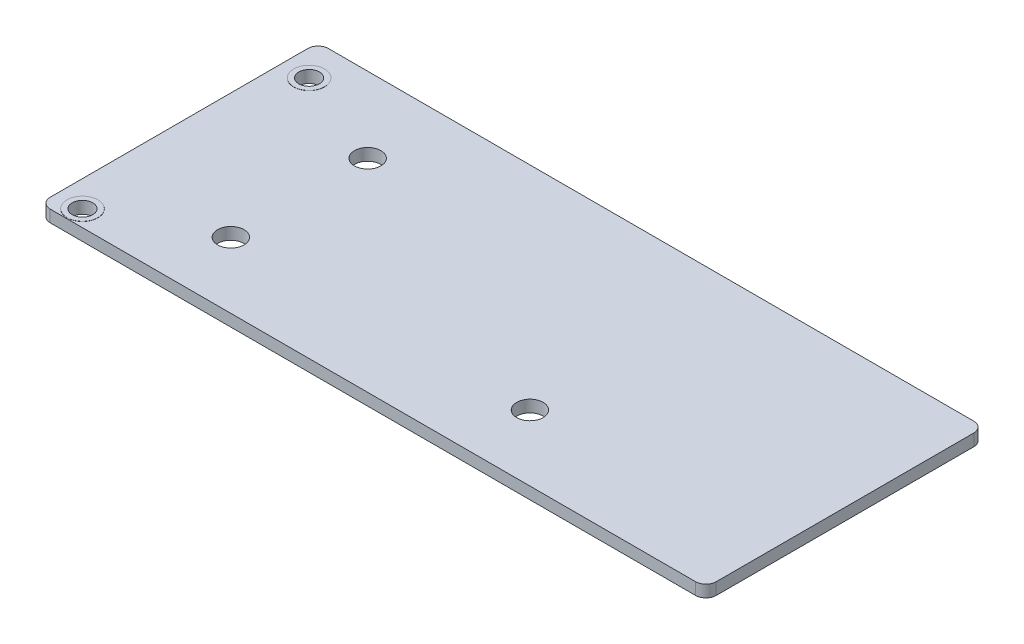
ISO-10303-21;
HEADER;
FILE_DESCRIPTION(('STEP AP214'),'2;1');
FILE_NAME('part.step','',(''),(''),'','','');
FILE_SCHEMA(('AUTOMOTIVE_DESIGN { 1 0 10303 214 1 1 1 1 }'));
ENDSEC;
DATA;
#1=APPLICATION_CONTEXT('core data for automotive mechanical design processes');
#2=APPLICATION_PROTOCOL_DEFINITION('international standard','automotive_design',2000,#1);
#3=PRODUCT_CONTEXT('',#1,'mechanical');
#4=PRODUCT('Part','Part','',(#3));
#5=PRODUCT_RELATED_PRODUCT_CATEGORY('part','',(#4));
#6=PRODUCT_DEFINITION_FORMATION('','',#4);
#7=PRODUCT_DEFINITION_CONTEXT('part definition',#1,'design');
#8=PRODUCT_DEFINITION('design','',#6,#7);
#9=PRODUCT_DEFINITION_SHAPE('','',#8);
#10=(LENGTH_UNIT() NAMED_UNIT(*) SI_UNIT(.MILLI.,.METRE.));
#11=(NAMED_UNIT(*) PLANE_ANGLE_UNIT() SI_UNIT($,.RADIAN.));
#12=(NAMED_UNIT(*) SI_UNIT($,.STERADIAN.) SOLID_ANGLE_UNIT());
#13=UNCERTAINTY_MEASURE_WITH_UNIT(LENGTH_MEASURE(1.E-05),#10,'distance_accuracy_value','');
#14=(GEOMETRIC_REPRESENTATION_CONTEXT(3) GLOBAL_UNCERTAINTY_ASSIGNED_CONTEXT((#13)) GLOBAL_UNIT_ASSIGNED_CONTEXT((#10,
#11,#12)) REPRESENTATION_CONTEXT('',''));
#15=CARTESIAN_POINT('',(0.,0.,0.));
#16=DIRECTION('',(0.,0.,1.));
#17=DIRECTION('',(1.,0.,0.));
#18=AXIS2_PLACEMENT_3D('',#15,#16,#17);
#19=CARTESIAN_POINT('',(32.325,1.16,13.5));
#20=DIRECTION('',(-1.,0.,0.));
#21=DIRECTION('',(0.,0.,1.));
#22=AXIS2_PLACEMENT_3D('',#19,#20,#21);
#23=PLANE('',#22);
#24=DIRECTION('',(0.,0.,-1.));
#25=VECTOR('',#24,1.);
#26=CARTESIAN_POINT('',(32.325,0.,13.5));
#27=LINE('',#26,#25);
#28=CARTESIAN_POINT('',(32.325,0.,12.5));
#29=VERTEX_POINT('',#28);
#30=CARTESIAN_POINT('',(32.325,0.,-12.5));
#31=VERTEX_POINT('',#30);
#32=EDGE_CURVE('E133',#29,#31,#27,.T.);
#33=ORIENTED_EDGE('',*,*,#32,.T.);
#34=DIRECTION('',(0.,-1.,0.));
#35=VECTOR('',#34,1.);
#36=CARTESIAN_POINT('',(32.325,1.16,-12.5));
#37=LINE('',#36,#35);
#38=CARTESIAN_POINT('',(32.325,1.16,-12.5));
#39=VERTEX_POINT('',#38);
#40=EDGE_CURVE('E156',#31,#39,#37,.F.);
#41=ORIENTED_EDGE('',*,*,#40,.T.);
#42=DIRECTION('',(0.,0.,-1.));
#43=VECTOR('',#42,1.);
#44=CARTESIAN_POINT('',(32.325,1.16,13.5));
#45=LINE('',#44,#43);
#46=CARTESIAN_POINT('',(32.325,1.16,12.5));
#47=VERTEX_POINT('',#46);
#48=EDGE_CURVE('E131',#47,#39,#45,.T.);
#49=ORIENTED_EDGE('',*,*,#48,.F.);
#50=DIRECTION('',(0.,-1.,0.));
#51=VECTOR('',#50,1.);
#52=CARTESIAN_POINT('',(32.325,1.16,12.5));
#53=LINE('',#52,#51);
#54=EDGE_CURVE('E153',#47,#29,#53,.T.);
#55=ORIENTED_EDGE('',*,*,#54,.T.);
#56=EDGE_LOOP('',(#33,#41,#49,#55));
#57=FACE_BOUND('',#56,.T.);
#58=ADVANCED_FACE('F36',(#57),#23,.F.);
#59=CARTESIAN_POINT('',(-32.325,1.16,-13.5));
#60=DIRECTION('',(0.,0.,1.));
#61=DIRECTION('',(1.,0.,0.));
#62=AXIS2_PLACEMENT_3D('',#59,#60,#61);
#63=PLANE('',#62);
#64=DIRECTION('',(-1.,0.,0.));
#65=VECTOR('',#64,1.);
#66=CARTESIAN_POINT('',(-32.325,0.,-13.5));
#67=LINE('',#66,#65);
#68=CARTESIAN_POINT('',(31.325,0.,-13.5));
#69=VERTEX_POINT('',#68);
#70=CARTESIAN_POINT('',(-31.325,0.,-13.5));
#71=VERTEX_POINT('',#70);
#72=EDGE_CURVE('E129',#69,#71,#67,.T.);
#73=ORIENTED_EDGE('',*,*,#72,.T.);
#74=DIRECTION('',(0.,-1.,0.));
#75=VECTOR('',#74,1.);
#76=CARTESIAN_POINT('',(-31.325,1.16,-13.5));
#77=LINE('',#76,#75);
#78=CARTESIAN_POINT('',(-31.325,1.16,-13.5));
#79=VERTEX_POINT('',#78);
#80=EDGE_CURVE('E108',#71,#79,#77,.F.);
#81=ORIENTED_EDGE('',*,*,#80,.T.);
#82=DIRECTION('',(-1.,0.,0.));
#83=VECTOR('',#82,1.);
#84=CARTESIAN_POINT('',(-32.325,1.16,-13.5));
#85=LINE('',#84,#83);
#86=CARTESIAN_POINT('',(31.325,1.16,-13.5));
#87=VERTEX_POINT('',#86);
#88=EDGE_CURVE('E195',#87,#79,#85,.T.);
#89=ORIENTED_EDGE('',*,*,#88,.F.);
#90=DIRECTION('',(0.,-1.,0.));
#91=VECTOR('',#90,1.);
#92=CARTESIAN_POINT('',(31.325,1.16,-13.5));
#93=LINE('',#92,#91);
#94=EDGE_CURVE('E113',#87,#69,#93,.T.);
#95=ORIENTED_EDGE('',*,*,#94,.T.);
#96=EDGE_LOOP('',(#73,#81,#89,#95));
#97=FACE_BOUND('',#96,.T.);
#98=ADVANCED_FACE('F214',(#97),#63,.F.);
#99=CARTESIAN_POINT('',(-32.325,1.16,13.5));
#100=DIRECTION('',(1.,0.,0.));
#101=DIRECTION('',(0.,0.,-1.));
#102=AXIS2_PLACEMENT_3D('',#99,#100,#101);
#103=PLANE('',#102);
#104=DIRECTION('',(0.,0.,1.));
#105=VECTOR('',#104,1.);
#106=CARTESIAN_POINT('',(-32.325,1.16,13.5));
#107=LINE('',#106,#105);
#108=CARTESIAN_POINT('',(-32.325,1.16,-12.5));
#109=VERTEX_POINT('',#108);
#110=CARTESIAN_POINT('',(-32.325,1.16,12.5));
#111=VERTEX_POINT('',#110);
#112=EDGE_CURVE('E122',#109,#111,#107,.T.);
#113=ORIENTED_EDGE('',*,*,#112,.F.);
#114=DIRECTION('',(0.,-1.,0.));
#115=VECTOR('',#114,1.);
#116=CARTESIAN_POINT('',(-32.325,1.16,-12.5));
#117=LINE('',#116,#115);
#118=CARTESIAN_POINT('',(-32.325,0.,-12.5));
#119=VERTEX_POINT('',#118);
#120=EDGE_CURVE('E107',#109,#119,#117,.T.);
#121=ORIENTED_EDGE('',*,*,#120,.T.);
#122=DIRECTION('',(0.,0.,1.));
#123=VECTOR('',#122,1.);
#124=CARTESIAN_POINT('',(-32.325,0.,13.5));
#125=LINE('',#124,#123);
#126=CARTESIAN_POINT('',(-32.325,0.,12.5));
#127=VERTEX_POINT('',#126);
#128=EDGE_CURVE('E120',#119,#127,#125,.T.);
#129=ORIENTED_EDGE('',*,*,#128,.T.);
#130=DIRECTION('',(0.,-1.,0.));
#131=VECTOR('',#130,1.);
#132=CARTESIAN_POINT('',(-32.325,1.16,12.5));
#133=LINE('',#132,#131);
#134=EDGE_CURVE('E124',#127,#111,#133,.F.);
#135=ORIENTED_EDGE('',*,*,#134,.T.);
#136=EDGE_LOOP('',(#113,#121,#129,#135));
#137=FACE_BOUND('',#136,.T.);
#138=ADVANCED_FACE('F119',(#137),#103,.F.);
#139=CARTESIAN_POINT('',(-32.325,1.16,13.5));
#140=DIRECTION('',(0.,0.,-1.));
#141=DIRECTION('',(-1.,0.,0.));
#142=AXIS2_PLACEMENT_3D('',#139,#140,#141);
#143=PLANE('',#142);
#144=DIRECTION('',(1.,0.,0.));
#145=VECTOR('',#144,1.);
#146=CARTESIAN_POINT('',(-32.325,0.,13.5));
#147=LINE('',#146,#145);
#148=CARTESIAN_POINT('',(-31.325,0.,13.5));
#149=VERTEX_POINT('',#148);
#150=CARTESIAN_POINT('',(31.325,0.,13.5));
#151=VERTEX_POINT('',#150);
#152=EDGE_CURVE('E128',#149,#151,#147,.T.);
#153=ORIENTED_EDGE('',*,*,#152,.T.);
#154=DIRECTION('',(0.,-1.,0.));
#155=VECTOR('',#154,1.);
#156=CARTESIAN_POINT('',(31.325,1.16,13.5));
#157=LINE('',#156,#155);
#158=CARTESIAN_POINT('',(31.325,1.16,13.5));
#159=VERTEX_POINT('',#158);
#160=EDGE_CURVE('E51',#151,#159,#157,.F.);
#161=ORIENTED_EDGE('',*,*,#160,.T.);
#162=DIRECTION('',(1.,0.,0.));
#163=VECTOR('',#162,1.);
#164=CARTESIAN_POINT('',(-32.325,1.16,13.5));
#165=LINE('',#164,#163);
#166=CARTESIAN_POINT('',(-31.325,1.16,13.5));
#167=VERTEX_POINT('',#166);
#168=EDGE_CURVE('E137',#167,#159,#165,.T.);
#169=ORIENTED_EDGE('',*,*,#168,.F.);
#170=DIRECTION('',(0.,-1.,0.));
#171=VECTOR('',#170,1.);
#172=CARTESIAN_POINT('',(-31.325,1.16,13.5));
#173=LINE('',#172,#171);
#174=EDGE_CURVE('E158',#167,#149,#173,.T.);
#175=ORIENTED_EDGE('',*,*,#174,.T.);
#176=EDGE_LOOP('',(#153,#161,#169,#175));
#177=FACE_BOUND('',#176,.T.);
#178=ADVANCED_FACE('F216',(#177),#143,.F.);
#179=CARTESIAN_POINT('',(0.,1.16,0.));
#180=DIRECTION('',(0.,-1.,0.));
#181=DIRECTION('',(0.,0.,-1.));
#182=AXIS2_PLACEMENT_3D('',#179,#180,#181);
#183=PLANE('',#182);
#184=CARTESIAN_POINT('',(-29.775,1.16,-10.08));
#185=DIRECTION('',(0.,-1.,0.));
#186=DIRECTION('',(0.,0.,-1.));
#187=AXIS2_PLACEMENT_3D('',#184,#185,#186);
#188=CIRCLE('',#187,1.5);
#189=CARTESIAN_POINT('',(-29.775,1.16,-11.58));
#190=VERTEX_POINT('',#189);
#191=EDGE_CURVE('E309',#190,#190,#188,.T.);
#192=ORIENTED_EDGE('',*,*,#191,.T.);
#193=EDGE_LOOP('',(#192));
#194=FACE_BOUND('',#193,.T.);
#195=CARTESIAN_POINT('',(-29.775,1.16,11.92));
#196=DIRECTION('',(0.,-1.,0.));
#197=DIRECTION('',(0.,0.,-1.));
#198=AXIS2_PLACEMENT_3D('',#195,#196,#197);
#199=CIRCLE('',#198,1.5);
#200=CARTESIAN_POINT('',(-29.775,1.16,10.42));
#201=VERTEX_POINT('',#200);
#202=EDGE_CURVE('E324',#201,#201,#199,.T.);
#203=ORIENTED_EDGE('',*,*,#202,.T.);
#204=EDGE_LOOP('',(#203));
#205=FACE_BOUND('',#204,.T.);
#206=CARTESIAN_POINT('',(8.845,1.16,7.105));
#207=DIRECTION('',(0.,1.,0.));
#208=DIRECTION('',(0.,0.,1.));
#209=AXIS2_PLACEMENT_3D('',#206,#207,#208);
#210=CIRCLE('',#209,1.285);
#211=CARTESIAN_POINT('',(8.845,1.16,8.39));
#212=VERTEX_POINT('',#211);
#213=EDGE_CURVE('E190',#212,#212,#210,.T.);
#214=ORIENTED_EDGE('',*,*,#213,.F.);
#215=EDGE_LOOP('',(#214));
#216=FACE_BOUND('',#215,.T.);
#217=CARTESIAN_POINT('',(-20.19,1.16,-6.18));
#218=DIRECTION('',(0.,1.,0.));
#219=DIRECTION('',(0.,0.,1.));
#220=AXIS2_PLACEMENT_3D('',#217,#218,#219);
#221=CIRCLE('',#220,1.285);
#222=CARTESIAN_POINT('',(-20.19,1.16,-4.895));
#223=VERTEX_POINT('',#222);
#224=EDGE_CURVE('E328',#223,#223,#221,.T.);
#225=ORIENTED_EDGE('',*,*,#224,.F.);
#226=EDGE_LOOP('',(#225));
#227=FACE_BOUND('',#226,.T.);
#228=CARTESIAN_POINT('',(-20.19,1.16,7.105));
#229=DIRECTION('',(0.,1.,0.));
#230=DIRECTION('',(0.,0.,1.));
#231=AXIS2_PLACEMENT_3D('',#228,#229,#230);
#232=CIRCLE('',#231,1.285);
#233=CARTESIAN_POINT('',(-20.19,1.16,8.39));
#234=VERTEX_POINT('',#233);
#235=EDGE_CURVE('E184',#234,#234,#232,.T.);
#236=ORIENTED_EDGE('',*,*,#235,.F.);
#237=EDGE_LOOP('',(#236));
#238=FACE_BOUND('',#237,.T.);
#239=ORIENTED_EDGE('',*,*,#88,.T.);
#240=CARTESIAN_POINT('',(-31.325,1.16,-12.5));
#241=DIRECTION('',(0.,-1.,0.));
#242=DIRECTION('',(0.,0.,-1.));
#243=AXIS2_PLACEMENT_3D('',#240,#241,#242);
#244=CIRCLE('',#243,1.);
#245=EDGE_CURVE('E151',#79,#109,#244,.F.);
#246=ORIENTED_EDGE('',*,*,#245,.T.);
#247=ORIENTED_EDGE('',*,*,#112,.T.);
#248=CARTESIAN_POINT('',(-31.325,1.16,12.5));
#249=DIRECTION('',(0.,-1.,0.));
#250=DIRECTION('',(0.,0.,-1.));
#251=AXIS2_PLACEMENT_3D('',#248,#249,#250);
#252=CIRCLE('',#251,1.);
#253=EDGE_CURVE('E58',#111,#167,#252,.F.);
#254=ORIENTED_EDGE('',*,*,#253,.T.);
#255=ORIENTED_EDGE('',*,*,#168,.T.);
#256=CARTESIAN_POINT('',(31.325,1.16,12.5));
#257=DIRECTION('',(0.,-1.,0.));
#258=DIRECTION('',(0.,0.,-1.));
#259=AXIS2_PLACEMENT_3D('',#256,#257,#258);
#260=CIRCLE('',#259,1.);
#261=EDGE_CURVE('E147',#159,#47,#260,.F.);
#262=ORIENTED_EDGE('',*,*,#261,.T.);
#263=ORIENTED_EDGE('',*,*,#48,.T.);
#264=CARTESIAN_POINT('',(31.325,1.16,-12.5));
#265=DIRECTION('',(0.,-1.,0.));
#266=DIRECTION('',(0.,0.,-1.));
#267=AXIS2_PLACEMENT_3D('',#264,#265,#266);
#268=CIRCLE('',#267,1.);
#269=EDGE_CURVE('E149',#39,#87,#268,.F.);
#270=ORIENTED_EDGE('',*,*,#269,.T.);
#271=EDGE_LOOP('',(#239,#246,#247,#254,#255,#262,#263,#270));
#272=FACE_BOUND('',#271,.T.);
#273=ADVANCED_FACE('F169',(#194,#205,#216,#227,#238,#272),#183,.F.);
#274=CARTESIAN_POINT('',(0.,0.,0.));
#275=DIRECTION('',(0.,-1.,0.));
#276=DIRECTION('',(0.,0.,-1.));
#277=AXIS2_PLACEMENT_3D('',#274,#275,#276);
#278=PLANE('',#277);
#279=CARTESIAN_POINT('',(-29.775,0.,-10.08));
#280=DIRECTION('',(0.,-1.,0.));
#281=DIRECTION('',(0.,0.,-1.));
#282=AXIS2_PLACEMENT_3D('',#279,#280,#281);
#283=CIRCLE('',#282,1.5);
#284=CARTESIAN_POINT('',(-29.775,0.,-11.58));
#285=VERTEX_POINT('',#284);
#286=EDGE_CURVE('E11',#285,#285,#283,.T.);
#287=ORIENTED_EDGE('',*,*,#286,.F.);
#288=EDGE_LOOP('',(#287));
#289=FACE_BOUND('',#288,.T.);
#290=CARTESIAN_POINT('',(-29.775,0.,11.92));
#291=DIRECTION('',(0.,-1.,0.));
#292=DIRECTION('',(0.,0.,-1.));
#293=AXIS2_PLACEMENT_3D('',#290,#291,#292);
#294=CIRCLE('',#293,1.5);
#295=CARTESIAN_POINT('',(-29.775,0.,10.42));
#296=VERTEX_POINT('',#295);
#297=EDGE_CURVE('E44',#296,#296,#294,.T.);
#298=ORIENTED_EDGE('',*,*,#297,.F.);
#299=EDGE_LOOP('',(#298));
#300=FACE_BOUND('',#299,.T.);
#301=CARTESIAN_POINT('',(8.845,0.,7.105));
#302=DIRECTION('',(0.,1.,0.));
#303=DIRECTION('',(0.,0.,1.));
#304=AXIS2_PLACEMENT_3D('',#301,#302,#303);
#305=CIRCLE('',#304,1.285);
#306=CARTESIAN_POINT('',(8.845,0.,8.39));
#307=VERTEX_POINT('',#306);
#308=EDGE_CURVE('E175',#307,#307,#305,.T.);
#309=ORIENTED_EDGE('',*,*,#308,.T.);
#310=EDGE_LOOP('',(#309));
#311=FACE_BOUND('',#310,.T.);
#312=CARTESIAN_POINT('',(-20.19,0.,-6.18));
#313=DIRECTION('',(0.,1.,0.));
#314=DIRECTION('',(0.,0.,1.));
#315=AXIS2_PLACEMENT_3D('',#312,#313,#314);
#316=CIRCLE('',#315,1.285);
#317=CARTESIAN_POINT('',(-20.19,0.,-4.895));
#318=VERTEX_POINT('',#317);
#319=EDGE_CURVE('E179',#318,#318,#316,.T.);
#320=ORIENTED_EDGE('',*,*,#319,.T.);
#321=EDGE_LOOP('',(#320));
#322=FACE_BOUND('',#321,.T.);
#323=CARTESIAN_POINT('',(-20.19,0.,7.105));
#324=DIRECTION('',(0.,1.,0.));
#325=DIRECTION('',(0.,0.,1.));
#326=AXIS2_PLACEMENT_3D('',#323,#324,#325);
#327=CIRCLE('',#326,1.285);
#328=CARTESIAN_POINT('',(-20.19,0.,8.39));
#329=VERTEX_POINT('',#328);
#330=EDGE_CURVE('E182',#329,#329,#327,.T.);
#331=ORIENTED_EDGE('',*,*,#330,.T.);
#332=EDGE_LOOP('',(#331));
#333=FACE_BOUND('',#332,.T.);
#334=ORIENTED_EDGE('',*,*,#128,.F.);
#335=CARTESIAN_POINT('',(-31.325,0.,-12.5));
#336=DIRECTION('',(0.,-1.,0.));
#337=DIRECTION('',(0.,0.,-1.));
#338=AXIS2_PLACEMENT_3D('',#335,#336,#337);
#339=CIRCLE('',#338,1.);
#340=EDGE_CURVE('E103',#119,#71,#339,.T.);
#341=ORIENTED_EDGE('',*,*,#340,.T.);
#342=ORIENTED_EDGE('',*,*,#72,.F.);
#343=CARTESIAN_POINT('',(31.325,0.,-12.5));
#344=DIRECTION('',(0.,-1.,0.));
#345=DIRECTION('',(0.,0.,-1.));
#346=AXIS2_PLACEMENT_3D('',#343,#344,#345);
#347=CIRCLE('',#346,1.);
#348=EDGE_CURVE('E114',#69,#31,#347,.T.);
#349=ORIENTED_EDGE('',*,*,#348,.T.);
#350=ORIENTED_EDGE('',*,*,#32,.F.);
#351=CARTESIAN_POINT('',(31.325,0.,12.5));
#352=DIRECTION('',(0.,-1.,0.));
#353=DIRECTION('',(0.,0.,-1.));
#354=AXIS2_PLACEMENT_3D('',#351,#352,#353);
#355=CIRCLE('',#354,1.);
#356=EDGE_CURVE('E140',#29,#151,#355,.T.);
#357=ORIENTED_EDGE('',*,*,#356,.T.);
#358=ORIENTED_EDGE('',*,*,#152,.F.);
#359=CARTESIAN_POINT('',(-31.325,0.,12.5));
#360=DIRECTION('',(0.,-1.,0.));
#361=DIRECTION('',(0.,0.,-1.));
#362=AXIS2_PLACEMENT_3D('',#359,#360,#361);
#363=CIRCLE('',#362,1.);
#364=EDGE_CURVE('E123',#149,#127,#363,.T.);
#365=ORIENTED_EDGE('',*,*,#364,.T.);
#366=EDGE_LOOP('',(#334,#341,#342,#349,#350,#357,#358,#365));
#367=FACE_BOUND('',#366,.T.);
#368=ADVANCED_FACE('F126',(#289,#300,#311,#322,#333,#367),#278,.T.);
#369=CARTESIAN_POINT('',(-31.325,1.16,-12.5));
#370=DIRECTION('',(0.,-1.,0.));
#371=DIRECTION('',(0.,0.,-1.));
#372=AXIS2_PLACEMENT_3D('',#369,#370,#371);
#373=CYLINDRICAL_SURFACE('',#372,1.);
#374=ORIENTED_EDGE('',*,*,#245,.F.);
#375=ORIENTED_EDGE('',*,*,#80,.F.);
#376=ORIENTED_EDGE('',*,*,#340,.F.);
#377=ORIENTED_EDGE('',*,*,#120,.F.);
#378=EDGE_LOOP('',(#374,#375,#376,#377));
#379=FACE_BOUND('',#378,.T.);
#380=ADVANCED_FACE('F106',(#379),#373,.T.);
#381=CARTESIAN_POINT('',(31.325,1.16,-12.5));
#382=DIRECTION('',(0.,-1.,0.));
#383=DIRECTION('',(0.,0.,-1.));
#384=AXIS2_PLACEMENT_3D('',#381,#382,#383);
#385=CYLINDRICAL_SURFACE('',#384,1.);
#386=ORIENTED_EDGE('',*,*,#269,.F.);
#387=ORIENTED_EDGE('',*,*,#40,.F.);
#388=ORIENTED_EDGE('',*,*,#348,.F.);
#389=ORIENTED_EDGE('',*,*,#94,.F.);
#390=EDGE_LOOP('',(#386,#387,#388,#389));
#391=FACE_BOUND('',#390,.T.);
#392=ADVANCED_FACE('F211',(#391),#385,.T.);
#393=CARTESIAN_POINT('',(31.325,1.16,12.5));
#394=DIRECTION('',(0.,-1.,0.));
#395=DIRECTION('',(0.,0.,-1.));
#396=AXIS2_PLACEMENT_3D('',#393,#394,#395);
#397=CYLINDRICAL_SURFACE('',#396,1.);
#398=ORIENTED_EDGE('',*,*,#261,.F.);
#399=ORIENTED_EDGE('',*,*,#160,.F.);
#400=ORIENTED_EDGE('',*,*,#356,.F.);
#401=ORIENTED_EDGE('',*,*,#54,.F.);
#402=EDGE_LOOP('',(#398,#399,#400,#401));
#403=FACE_BOUND('',#402,.T.);
#404=ADVANCED_FACE('F204',(#403),#397,.T.);
#405=CARTESIAN_POINT('',(-31.325,1.16,12.5));
#406=DIRECTION('',(0.,-1.,0.));
#407=DIRECTION('',(0.,0.,-1.));
#408=AXIS2_PLACEMENT_3D('',#405,#406,#407);
#409=CYLINDRICAL_SURFACE('',#408,1.);
#410=ORIENTED_EDGE('',*,*,#253,.F.);
#411=ORIENTED_EDGE('',*,*,#134,.F.);
#412=ORIENTED_EDGE('',*,*,#364,.F.);
#413=ORIENTED_EDGE('',*,*,#174,.F.);
#414=EDGE_LOOP('',(#410,#411,#412,#413));
#415=FACE_BOUND('',#414,.T.);
#416=ADVANCED_FACE('F38',(#415),#409,.T.);
#417=CARTESIAN_POINT('',(-20.19,0.,7.105));
#418=DIRECTION('',(0.,1.,0.));
#419=DIRECTION('',(0.,0.,1.));
#420=AXIS2_PLACEMENT_3D('',#417,#418,#419);
#421=CYLINDRICAL_SURFACE('',#420,1.285);
#422=ORIENTED_EDGE('',*,*,#330,.F.);
#423=EDGE_LOOP('',(#422));
#424=FACE_BOUND('',#423,.T.);
#425=ORIENTED_EDGE('',*,*,#235,.T.);
#426=EDGE_LOOP('',(#425));
#427=FACE_BOUND('',#426,.T.);
#428=ADVANCED_FACE('F240',(#424,#427),#421,.F.);
#429=CARTESIAN_POINT('',(-20.19,0.,-6.18));
#430=DIRECTION('',(0.,1.,0.));
#431=DIRECTION('',(0.,0.,1.));
#432=AXIS2_PLACEMENT_3D('',#429,#430,#431);
#433=CYLINDRICAL_SURFACE('',#432,1.285);
#434=ORIENTED_EDGE('',*,*,#319,.F.);
#435=EDGE_LOOP('',(#434));
#436=FACE_BOUND('',#435,.T.);
#437=ORIENTED_EDGE('',*,*,#224,.T.);
#438=EDGE_LOOP('',(#437));
#439=FACE_BOUND('',#438,.T.);
#440=ADVANCED_FACE('F244',(#436,#439),#433,.F.);
#441=CARTESIAN_POINT('',(8.845,0.,7.105));
#442=DIRECTION('',(0.,1.,0.));
#443=DIRECTION('',(0.,0.,1.));
#444=AXIS2_PLACEMENT_3D('',#441,#442,#443);
#445=CYLINDRICAL_SURFACE('',#444,1.285);
#446=ORIENTED_EDGE('',*,*,#308,.F.);
#447=EDGE_LOOP('',(#446));
#448=FACE_BOUND('',#447,.T.);
#449=ORIENTED_EDGE('',*,*,#213,.T.);
#450=EDGE_LOOP('',(#449));
#451=FACE_BOUND('',#450,.T.);
#452=ADVANCED_FACE('F249',(#448,#451),#445,.F.);
#453=CARTESIAN_POINT('',(-29.775,-0.0049999999999998,11.92));
#454=DIRECTION('',(0.,1.,0.));
#455=DIRECTION('',(0.,0.,1.));
#456=AXIS2_PLACEMENT_3D('',#453,#454,#455);
#457=CYLINDRICAL_SURFACE('',#456,1.5);
#458=ORIENTED_EDGE('',*,*,#297,.T.);
#459=EDGE_LOOP('',(#458));
#460=FACE_BOUND('',#459,.T.);
#461=CARTESIAN_POINT('',(-29.775,-0.0049999999999998,11.92));
#462=DIRECTION('',(0.,1.,0.));
#463=DIRECTION('',(0.,0.,1.));
#464=AXIS2_PLACEMENT_3D('',#461,#462,#463);
#465=CIRCLE('',#464,1.5);
#466=CARTESIAN_POINT('',(-29.775,-0.0049999999999998,13.42));
#467=VERTEX_POINT('',#466);
#468=EDGE_CURVE('E321',#467,#467,#465,.T.);
#469=ORIENTED_EDGE('',*,*,#468,.T.);
#470=EDGE_LOOP('',(#469));
#471=FACE_BOUND('',#470,.T.);
#472=ADVANCED_FACE('F164',(#460,#471),#457,.T.);
#473=CARTESIAN_POINT('',(-29.775,-0.0049999999999998,11.92));
#474=DIRECTION('',(0.,1.,0.));
#475=DIRECTION('',(0.,0.,1.));
#476=AXIS2_PLACEMENT_3D('',#473,#474,#475);
#477=PLANE('',#476);
#478=CARTESIAN_POINT('',(-29.775,-0.0049999999999998,11.92));
#479=DIRECTION('',(0.,1.,0.));
#480=DIRECTION('',(0.,0.,1.));
#481=AXIS2_PLACEMENT_3D('',#478,#479,#480);
#482=CIRCLE('',#481,1.);
#483=CARTESIAN_POINT('',(-29.775,-0.0049999999999998,12.92));
#484=VERTEX_POINT('',#483);
#485=EDGE_CURVE('E318',#484,#484,#482,.T.);
#486=ORIENTED_EDGE('',*,*,#485,.T.);
#487=EDGE_LOOP('',(#486));
#488=FACE_BOUND('',#487,.T.);
#489=ORIENTED_EDGE('',*,*,#468,.F.);
#490=EDGE_LOOP('',(#489));
#491=FACE_BOUND('',#490,.T.);
#492=ADVANCED_FACE('F267',(#488,#491),#477,.F.);
#493=CARTESIAN_POINT('',(-29.775,0.,11.92));
#494=DIRECTION('',(0.,1.,0.));
#495=DIRECTION('',(0.,0.,1.));
#496=AXIS2_PLACEMENT_3D('',#493,#494,#495);
#497=CYLINDRICAL_SURFACE('',#496,1.);
#498=ORIENTED_EDGE('',*,*,#485,.F.);
#499=EDGE_LOOP('',(#498));
#500=FACE_BOUND('',#499,.T.);
#501=CARTESIAN_POINT('',(-29.775,1.175,11.92));
#502=DIRECTION('',(0.,1.,0.));
#503=DIRECTION('',(0.,0.,1.));
#504=AXIS2_PLACEMENT_3D('',#501,#502,#503);
#505=CIRCLE('',#504,1.);
#506=CARTESIAN_POINT('',(-29.775,1.175,12.92));
#507=VERTEX_POINT('',#506);
#508=EDGE_CURVE('E312',#507,#507,#505,.T.);
#509=ORIENTED_EDGE('',*,*,#508,.T.);
#510=EDGE_LOOP('',(#509));
#511=FACE_BOUND('',#510,.T.);
#512=ADVANCED_FACE('F263',(#500,#511),#497,.F.);
#513=CARTESIAN_POINT('',(-29.775,1.175,11.92));
#514=DIRECTION('',(0.,1.,0.));
#515=DIRECTION('',(0.,0.,1.));
#516=AXIS2_PLACEMENT_3D('',#513,#514,#515);
#517=CIRCLE('',#516,1.5);
#518=CARTESIAN_POINT('',(-29.775,1.175,13.42));
#519=VERTEX_POINT('',#518);
#520=EDGE_CURVE('E315',#519,#519,#517,.T.);
#521=ORIENTED_EDGE('',*,*,#520,.F.);
#522=EDGE_LOOP('',(#521));
#523=FACE_BOUND('',#522,.T.);
#524=ORIENTED_EDGE('',*,*,#202,.F.);
#525=EDGE_LOOP('',(#524));
#526=FACE_BOUND('',#525,.T.);
#527=ADVANCED_FACE('F266',(#523,#526),#457,.T.);
#528=CARTESIAN_POINT('',(-29.775,1.175,11.92));
#529=DIRECTION('',(0.,1.,0.));
#530=DIRECTION('',(0.,0.,1.));
#531=AXIS2_PLACEMENT_3D('',#528,#529,#530);
#532=PLANE('',#531);
#533=ORIENTED_EDGE('',*,*,#520,.T.);
#534=EDGE_LOOP('',(#533));
#535=FACE_BOUND('',#534,.T.);
#536=ORIENTED_EDGE('',*,*,#508,.F.);
#537=EDGE_LOOP('',(#536));
#538=FACE_BOUND('',#537,.T.);
#539=ADVANCED_FACE('F274',(#535,#538),#532,.T.);
#540=CARTESIAN_POINT('',(-29.775,-0.0049999999999998,-10.08));
#541=DIRECTION('',(0.,1.,0.));
#542=DIRECTION('',(0.,0.,1.));
#543=AXIS2_PLACEMENT_3D('',#540,#541,#542);
#544=CYLINDRICAL_SURFACE('',#543,1.5);
#545=ORIENTED_EDGE('',*,*,#286,.T.);
#546=EDGE_LOOP('',(#545));
#547=FACE_BOUND('',#546,.T.);
#548=CARTESIAN_POINT('',(-29.775,-0.0049999999999998,-10.08));
#549=DIRECTION('',(0.,1.,0.));
#550=DIRECTION('',(0.,0.,1.));
#551=AXIS2_PLACEMENT_3D('',#548,#549,#550);
#552=CIRCLE('',#551,1.5);
#553=CARTESIAN_POINT('',(-29.775,-0.0049999999999998,-8.58));
#554=VERTEX_POINT('',#553);
#555=EDGE_CURVE('E306',#554,#554,#552,.T.);
#556=ORIENTED_EDGE('',*,*,#555,.T.);
#557=EDGE_LOOP('',(#556));
#558=FACE_BOUND('',#557,.T.);
#559=ADVANCED_FACE('F277',(#547,#558),#544,.T.);
#560=CARTESIAN_POINT('',(-29.775,-0.0049999999999998,-10.08));
#561=DIRECTION('',(0.,1.,0.));
#562=DIRECTION('',(0.,0.,1.));
#563=AXIS2_PLACEMENT_3D('',#560,#561,#562);
#564=PLANE('',#563);
#565=CARTESIAN_POINT('',(-29.775,-0.0049999999999998,-10.08));
#566=DIRECTION('',(0.,1.,0.));
#567=DIRECTION('',(0.,0.,1.));
#568=AXIS2_PLACEMENT_3D('',#565,#566,#567);
#569=CIRCLE('',#568,1.);
#570=CARTESIAN_POINT('',(-29.775,-0.0049999999999998,-9.08));
#571=VERTEX_POINT('',#570);
#572=EDGE_CURVE('E301',#571,#571,#569,.T.);
#573=ORIENTED_EDGE('',*,*,#572,.T.);
#574=EDGE_LOOP('',(#573));
#575=FACE_BOUND('',#574,.T.);
#576=ORIENTED_EDGE('',*,*,#555,.F.);
#577=EDGE_LOOP('',(#576));
#578=FACE_BOUND('',#577,.T.);
#579=ADVANCED_FACE('F258',(#575,#578),#564,.F.);
#580=CARTESIAN_POINT('',(-29.775,0.,-10.08));
#581=DIRECTION('',(0.,1.,0.));
#582=DIRECTION('',(0.,0.,1.));
#583=AXIS2_PLACEMENT_3D('',#580,#581,#582);
#584=CYLINDRICAL_SURFACE('',#583,1.);
#585=ORIENTED_EDGE('',*,*,#572,.F.);
#586=EDGE_LOOP('',(#585));
#587=FACE_BOUND('',#586,.T.);
#588=CARTESIAN_POINT('',(-29.775,1.175,-10.08));
#589=DIRECTION('',(0.,1.,0.));
#590=DIRECTION('',(0.,0.,1.));
#591=AXIS2_PLACEMENT_3D('',#588,#589,#590);
#592=CIRCLE('',#591,1.);
#593=CARTESIAN_POINT('',(-29.775,1.175,-9.08));
#594=VERTEX_POINT('',#593);
#595=EDGE_CURVE('E298',#594,#594,#592,.T.);
#596=ORIENTED_EDGE('',*,*,#595,.T.);
#597=EDGE_LOOP('',(#596));
#598=FACE_BOUND('',#597,.T.);
#599=ADVANCED_FACE('F254',(#587,#598),#584,.F.);
#600=CARTESIAN_POINT('',(-29.775,1.175,-10.08));
#601=DIRECTION('',(0.,1.,0.));
#602=DIRECTION('',(0.,0.,1.));
#603=AXIS2_PLACEMENT_3D('',#600,#601,#602);
#604=CIRCLE('',#603,1.5);
#605=CARTESIAN_POINT('',(-29.775,1.175,-8.58));
#606=VERTEX_POINT('',#605);
#607=EDGE_CURVE('E295',#606,#606,#604,.T.);
#608=ORIENTED_EDGE('',*,*,#607,.F.);
#609=EDGE_LOOP('',(#608));
#610=FACE_BOUND('',#609,.T.);
#611=ORIENTED_EDGE('',*,*,#191,.F.);
#612=EDGE_LOOP('',(#611));
#613=FACE_BOUND('',#612,.T.);
#614=ADVANCED_FACE('F257',(#610,#613),#544,.T.);
#615=CARTESIAN_POINT('',(-29.775,1.175,-10.08));
#616=DIRECTION('',(0.,1.,0.));
#617=DIRECTION('',(0.,0.,1.));
#618=AXIS2_PLACEMENT_3D('',#615,#616,#617);
#619=PLANE('',#618);
#620=ORIENTED_EDGE('',*,*,#607,.T.);
#621=EDGE_LOOP('',(#620));
#622=FACE_BOUND('',#621,.T.);
#623=ORIENTED_EDGE('',*,*,#595,.F.);
#624=EDGE_LOOP('',(#623));
#625=FACE_BOUND('',#624,.T.);
#626=ADVANCED_FACE('F285',(#622,#625),#619,.T.);
#627=CLOSED_SHELL('',(#58,#98,#138,#178,#273,#368,#380,#392,#404,#416,#428,#440,#452,#472,#492,
#512,#527,#539,#559,#579,#599,#614,#626));
#628=MANIFOLD_SOLID_BREP('B2',#627);
#629=ADVANCED_BREP_SHAPE_REPRESENTATION('',(#18,#628),#14);
#630=SHAPE_DEFINITION_REPRESENTATION(#9,#629);
ENDSEC;
END-ISO-10303-21;
